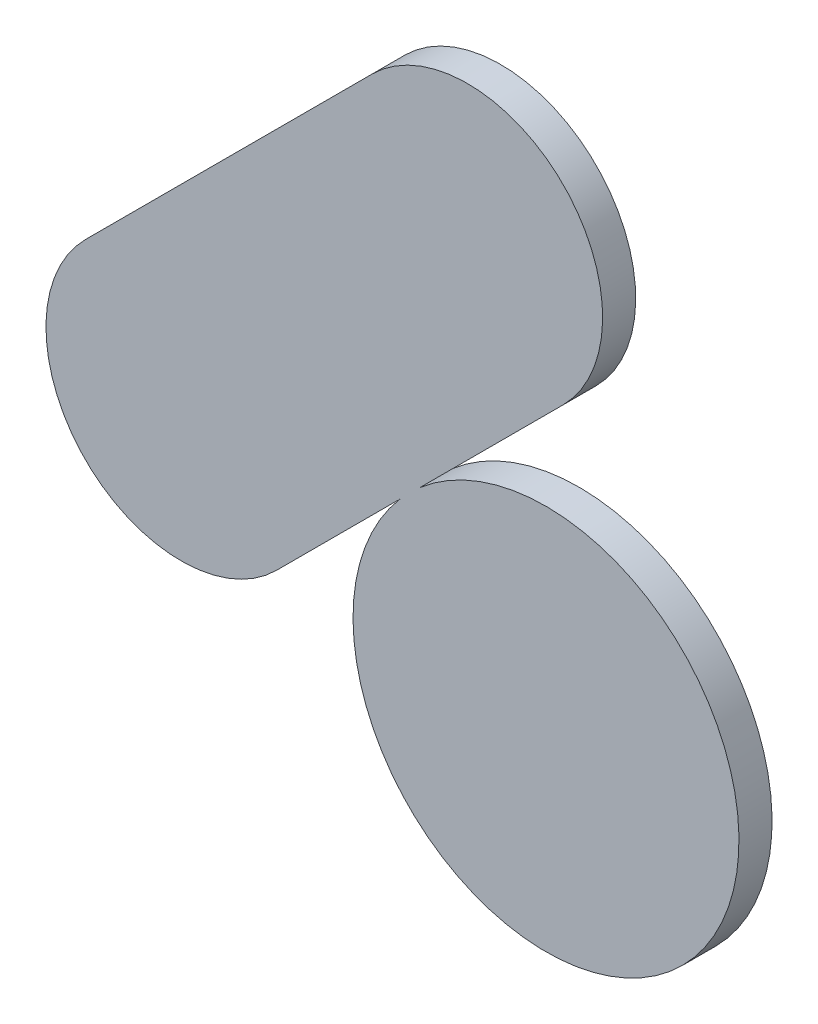
ISO-10303-21;
HEADER;
FILE_DESCRIPTION(('STEP AP214'),'2;1');
FILE_NAME('part.step','',(''),(''),'','','');
FILE_SCHEMA(('AUTOMOTIVE_DESIGN { 1 0 10303 214 1 1 1 1 }'));
ENDSEC;
DATA;
#1=APPLICATION_CONTEXT('core data for automotive mechanical design processes');
#2=APPLICATION_PROTOCOL_DEFINITION('international standard','automotive_design',2000,#1);
#3=PRODUCT_CONTEXT('',#1,'mechanical');
#4=PRODUCT('Part','Part','',(#3));
#5=PRODUCT_RELATED_PRODUCT_CATEGORY('part','',(#4));
#6=PRODUCT_DEFINITION_FORMATION('','',#4);
#7=PRODUCT_DEFINITION_CONTEXT('part definition',#1,'design');
#8=PRODUCT_DEFINITION('design','',#6,#7);
#9=PRODUCT_DEFINITION_SHAPE('','',#8);
#10=(LENGTH_UNIT() NAMED_UNIT(*) SI_UNIT(.MILLI.,.METRE.));
#11=(NAMED_UNIT(*) PLANE_ANGLE_UNIT() SI_UNIT($,.RADIAN.));
#12=(NAMED_UNIT(*) SI_UNIT($,.STERADIAN.) SOLID_ANGLE_UNIT());
#13=UNCERTAINTY_MEASURE_WITH_UNIT(LENGTH_MEASURE(1.E-05),#10,'distance_accuracy_value','');
#14=(GEOMETRIC_REPRESENTATION_CONTEXT(3) GLOBAL_UNCERTAINTY_ASSIGNED_CONTEXT((#13)) GLOBAL_UNIT_ASSIGNED_CONTEXT((#10,
#11,#12)) REPRESENTATION_CONTEXT('',''));
#15=CARTESIAN_POINT('',(0.,0.,0.));
#16=DIRECTION('',(0.,0.,1.));
#17=DIRECTION('',(1.,0.,0.));
#18=AXIS2_PLACEMENT_3D('',#15,#16,#17);
#19=CARTESIAN_POINT('',(4.884906784897,1.989149072895,0.76487));
#20=DIRECTION('',(0.,0.,-1.));
#21=DIRECTION('',(-1.,0.,0.));
#22=AXIS2_PLACEMENT_3D('',#19,#20,#21);
#23=PLANE('',#22);
#24=DIRECTION('',(-0.707105419013235,-0.707108143357235,0.));
#25=VECTOR('',#24,1.);
#26=CARTESIAN_POINT('',(5.0341823809,2.141318953102,0.76487));
#27=LINE('',#26,#25);
#28=CARTESIAN_POINT('',(5.03418264275081,2.14131921495382,0.76487));
#29=VERTEX_POINT('',#28);
#30=CARTESIAN_POINT('',(4.88566689599835,1.99280289599816,0.76487));
#31=VERTEX_POINT('',#30);
#32=EDGE_CURVE('E66',#29,#31,#27,.T.);
#33=ORIENTED_EDGE('',*,*,#32,.T.);
#34=CARTESIAN_POINT('',(5.0165,1.8415,0.76487));
#35=DIRECTION('',(0.,0.,1.));
#36=DIRECTION('',(1.,0.,0.));
#37=AXIS2_PLACEMENT_3D('',#34,#35,#36);
#38=CIRCLE('',#37,0.200024667079);
#39=CARTESIAN_POINT('',(4.86519710590654,1.97233310608354,0.76487));
#40=VERTEX_POINT('',#39);
#41=EDGE_CURVE('E20',#40,#31,#38,.T.);
#42=ORIENTED_EDGE('',*,*,#41,.F.);
#43=DIRECTION('',(-0.707106780699048,-0.707106781674048,0.));
#44=VECTOR('',#43,1.);
#45=CARTESIAN_POINT('',(4.865197105905,1.972333106082,0.76487));
#46=LINE('',#45,#44);
#47=CARTESIAN_POINT('',(4.73719797471687,1.84433397471738,0.76487));
#48=VERTEX_POINT('',#47);
#49=EDGE_CURVE('E91',#40,#48,#46,.T.);
#50=ORIENTED_EDGE('',*,*,#49,.T.);
#51=CARTESIAN_POINT('',(4.638203,1.943328898732,0.76487));
#52=DIRECTION('',(0.,0.,1.));
#53=DIRECTION('',(1.,0.,0.));
#54=AXIS2_PLACEMENT_3D('',#51,#52,#53);
#55=CIRCLE('',#54,0.14);
#56=CARTESIAN_POINT('',(4.53920807191728,2.04232349971486,0.76487));
#57=VERTEX_POINT('',#56);
#58=EDGE_CURVE('E103',#57,#48,#55,.T.);
#59=ORIENTED_EDGE('',*,*,#58,.F.);
#60=DIRECTION('',(0.707106099992719,0.707107462379719,0.));
#61=VECTOR('',#60,1.);
#62=CARTESIAN_POINT('',(4.5392082861,2.042323713898,0.76487));
#63=LINE('',#62,#61);
#64=CARTESIAN_POINT('',(4.83619264463338,2.33930864463353,0.76487));
#65=VERTEX_POINT('',#64);
#66=EDGE_CURVE('E94',#57,#65,#63,.T.);
#67=ORIENTED_EDGE('',*,*,#66,.T.);
#68=CARTESIAN_POINT('',(4.935187667,2.240313768268,0.76487));
#69=DIRECTION('',(0.,0.,1.));
#70=DIRECTION('',(1.,0.,0.));
#71=AXIS2_PLACEMENT_3D('',#68,#69,#70);
#72=CIRCLE('',#71,0.14);
#73=EDGE_CURVE('E70',#29,#65,#72,.T.);
#74=ORIENTED_EDGE('',*,*,#73,.F.);
#75=EDGE_LOOP('',(#33,#42,#50,#59,#67,#74));
#76=FACE_BOUND('',#75,.T.);
#77=ADVANCED_FACE('F17',(#76),#23,.T.);
#78=CARTESIAN_POINT('',(5.0165,1.8415,0.76487));
#79=DIRECTION('',(0.,0.,1.));
#80=DIRECTION('',(1.,0.,0.));
#81=AXIS2_PLACEMENT_3D('',#78,#79,#80);
#82=CYLINDRICAL_SURFACE('',#81,0.200024667079);
#83=ORIENTED_EDGE('',*,*,#41,.T.);
#84=DIRECTION('',(0.,0.,1.));
#85=VECTOR('',#84,1.);
#86=CARTESIAN_POINT('',(4.8856668960001,1.9928028959999,0.76487));
#87=LINE('',#86,#85);
#88=CARTESIAN_POINT('',(4.88566689599764,1.99280289599755,0.79916));
#89=VERTEX_POINT('',#88);
#90=EDGE_CURVE('E74',#31,#89,#87,.T.);
#91=ORIENTED_EDGE('',*,*,#90,.T.);
#92=CARTESIAN_POINT('',(5.0165,1.8415,0.79916));
#93=DIRECTION('',(0.,0.,1.));
#94=DIRECTION('',(1.,0.,0.));
#95=AXIS2_PLACEMENT_3D('',#92,#93,#94);
#96=CIRCLE('',#95,0.200024667);
#97=CARTESIAN_POINT('',(4.86519710590654,1.97233310608354,0.79916));
#98=VERTEX_POINT('',#97);
#99=EDGE_CURVE('E101',#98,#89,#96,.T.);
#100=ORIENTED_EDGE('',*,*,#99,.F.);
#101=DIRECTION('',(0.,0.,1.));
#102=VECTOR('',#101,1.);
#103=CARTESIAN_POINT('',(4.865197105905,1.972333106082,0.76487));
#104=LINE('',#103,#102);
#105=EDGE_CURVE('E81',#98,#40,#104,.F.);
#106=ORIENTED_EDGE('',*,*,#105,.T.);
#107=EDGE_LOOP('',(#83,#91,#100,#106));
#108=FACE_BOUND('',#107,.T.);
#109=ADVANCED_FACE('F78',(#108),#82,.T.);
#110=CARTESIAN_POINT('',(5.0341823809,2.141318953102,0.76487));
#111=DIRECTION('',(-0.707108143357235,0.707105419013235,0.));
#112=DIRECTION('',(-0.707105419013235,-0.707108143357235,0.));
#113=AXIS2_PLACEMENT_3D('',#110,#111,#112);
#114=PLANE('',#113);
#115=ORIENTED_EDGE('',*,*,#90,.F.);
#116=ORIENTED_EDGE('',*,*,#32,.F.);
#117=DIRECTION('',(0.,0.,1.));
#118=VECTOR('',#117,1.);
#119=CARTESIAN_POINT('',(5.0341823809,2.141318953102,0.76487));
#120=LINE('',#119,#118);
#121=CARTESIAN_POINT('',(5.03418264275078,2.14131921495379,0.79916));
#122=VERTEX_POINT('',#121);
#123=EDGE_CURVE('E86',#122,#29,#120,.F.);
#124=ORIENTED_EDGE('',*,*,#123,.F.);
#125=DIRECTION('',(0.707105419013689,0.707108143356782,0.));
#126=VECTOR('',#125,1.);
#127=CARTESIAN_POINT('',(4.885666896,1.992802896,0.79916));
#128=LINE('',#127,#126);
#129=EDGE_CURVE('E85',#89,#122,#128,.T.);
#130=ORIENTED_EDGE('',*,*,#129,.F.);
#131=EDGE_LOOP('',(#115,#116,#124,#130));
#132=FACE_BOUND('',#131,.T.);
#133=ADVANCED_FACE('F83',(#132),#114,.F.);
#134=CARTESIAN_POINT('',(4.935187667,2.240313768268,0.76487));
#135=DIRECTION('',(0.,0.,1.));
#136=DIRECTION('',(1.,0.,0.));
#137=AXIS2_PLACEMENT_3D('',#134,#135,#136);
#138=CYLINDRICAL_SURFACE('',#137,0.14);
#139=ORIENTED_EDGE('',*,*,#73,.T.);
#140=DIRECTION('',(0.,0.,1.));
#141=VECTOR('',#140,1.);
#142=CARTESIAN_POINT('',(4.8361926669999,2.3393086670001,0.76487));
#143=LINE('',#142,#141);
#144=CARTESIAN_POINT('',(4.83619264463344,2.3393086446335,0.79916));
#145=VERTEX_POINT('',#144);
#146=EDGE_CURVE('E95',#65,#145,#143,.T.);
#147=ORIENTED_EDGE('',*,*,#146,.T.);
#148=CARTESIAN_POINT('',(4.935188,2.240314,0.79916));
#149=DIRECTION('',(0.,0.,1.));
#150=DIRECTION('',(1.,0.,0.));
#151=AXIS2_PLACEMENT_3D('',#148,#149,#150);
#152=CIRCLE('',#151,0.139999667);
#153=EDGE_CURVE('E99',#122,#145,#152,.T.);
#154=ORIENTED_EDGE('',*,*,#153,.F.);
#155=ORIENTED_EDGE('',*,*,#123,.T.);
#156=EDGE_LOOP('',(#139,#147,#154,#155));
#157=FACE_BOUND('',#156,.T.);
#158=ADVANCED_FACE('F109',(#157),#138,.T.);
#159=CARTESIAN_POINT('',(4.5392082861,2.042323713898,0.76487));
#160=DIRECTION('',(0.707107462379719,-0.707106099992719,0.));
#161=DIRECTION('',(0.707106099992719,0.707107462379719,0.));
#162=AXIS2_PLACEMENT_3D('',#159,#160,#161);
#163=PLANE('',#162);
#164=ORIENTED_EDGE('',*,*,#146,.F.);
#165=ORIENTED_EDGE('',*,*,#66,.F.);
#166=DIRECTION('',(0.,0.,1.));
#167=VECTOR('',#166,1.);
#168=CARTESIAN_POINT('',(4.5392082861,2.042323713898,0.76487));
#169=LINE('',#168,#167);
#170=CARTESIAN_POINT('',(4.53920807191729,2.04232349971488,0.79916));
#171=VERTEX_POINT('',#170);
#172=EDGE_CURVE('E105',#171,#57,#169,.F.);
#173=ORIENTED_EDGE('',*,*,#172,.F.);
#174=DIRECTION('',(-0.707106099992947,-0.707107462379492,0.));
#175=VECTOR('',#174,1.);
#176=CARTESIAN_POINT('',(4.836192667,2.339308667,0.79916));
#177=LINE('',#176,#175);
#178=EDGE_CURVE('E98',#145,#171,#177,.T.);
#179=ORIENTED_EDGE('',*,*,#178,.F.);
#180=EDGE_LOOP('',(#164,#165,#173,#179));
#181=FACE_BOUND('',#180,.T.);
#182=ADVANCED_FACE('F114',(#181),#163,.F.);
#183=CARTESIAN_POINT('',(4.638203,1.943328898732,0.76487));
#184=DIRECTION('',(0.,0.,1.));
#185=DIRECTION('',(1.,0.,0.));
#186=AXIS2_PLACEMENT_3D('',#183,#184,#185);
#187=CYLINDRICAL_SURFACE('',#186,0.14);
#188=ORIENTED_EDGE('',*,*,#58,.T.);
#189=DIRECTION('',(0.,0.,1.));
#190=VECTOR('',#189,1.);
#191=CARTESIAN_POINT('',(4.73719799999975,1.84433400000025,0.76487));
#192=LINE('',#191,#190);
#193=CARTESIAN_POINT('',(4.7371979747171,1.84433397471735,0.79916));
#194=VERTEX_POINT('',#193);
#195=EDGE_CURVE('E93',#48,#194,#192,.T.);
#196=ORIENTED_EDGE('',*,*,#195,.T.);
#197=CARTESIAN_POINT('',(4.638202667,1.943328667,0.79916));
#198=DIRECTION('',(0.,0.,1.));
#199=DIRECTION('',(1.,0.,0.));
#200=AXIS2_PLACEMENT_3D('',#197,#198,#199);
#201=CIRCLE('',#200,0.139999667);
#202=EDGE_CURVE('E26',#171,#194,#201,.T.);
#203=ORIENTED_EDGE('',*,*,#202,.F.);
#204=ORIENTED_EDGE('',*,*,#172,.T.);
#205=EDGE_LOOP('',(#188,#196,#203,#204));
#206=FACE_BOUND('',#205,.T.);
#207=ADVANCED_FACE('F127',(#206),#187,.T.);
#208=CARTESIAN_POINT('',(4.865197105905,1.972333106082,0.76487));
#209=DIRECTION('',(-0.707106781674048,0.707106780699048,0.));
#210=DIRECTION('',(-0.707106780699048,-0.707106781674048,0.));
#211=AXIS2_PLACEMENT_3D('',#208,#209,#210);
#212=PLANE('',#211);
#213=ORIENTED_EDGE('',*,*,#195,.F.);
#214=ORIENTED_EDGE('',*,*,#49,.F.);
#215=ORIENTED_EDGE('',*,*,#105,.F.);
#216=DIRECTION('',(0.707106780697644,0.707106781675451,0.));
#217=VECTOR('',#216,1.);
#218=CARTESIAN_POINT('',(4.737198,1.844334,0.79916));
#219=LINE('',#218,#217);
#220=EDGE_CURVE('E11',#194,#98,#219,.T.);
#221=ORIENTED_EDGE('',*,*,#220,.F.);
#222=EDGE_LOOP('',(#213,#214,#215,#221));
#223=FACE_BOUND('',#222,.T.);
#224=ADVANCED_FACE('F125',(#223),#212,.F.);
#225=CARTESIAN_POINT('',(4.884906784897,1.989149072895,0.79916));
#226=DIRECTION('',(0.,0.,1.));
#227=DIRECTION('',(0.,-1.,0.));
#228=AXIS2_PLACEMENT_3D('',#225,#226,#227);
#229=PLANE('',#228);
#230=ORIENTED_EDGE('',*,*,#202,.T.);
#231=ORIENTED_EDGE('',*,*,#220,.T.);
#232=ORIENTED_EDGE('',*,*,#99,.T.);
#233=ORIENTED_EDGE('',*,*,#129,.T.);
#234=ORIENTED_EDGE('',*,*,#153,.T.);
#235=ORIENTED_EDGE('',*,*,#178,.T.);
#236=EDGE_LOOP('',(#230,#231,#232,#233,#234,#235));
#237=FACE_BOUND('',#236,.T.);
#238=ADVANCED_FACE('F121',(#237),#229,.T.);
#239=CLOSED_SHELL('',(#77,#109,#133,#158,#182,#207,#224,#238));
#240=MANIFOLD_SOLID_BREP('B1',#239);
#241=ADVANCED_BREP_SHAPE_REPRESENTATION('',(#18,#240),#14);
#242=SHAPE_DEFINITION_REPRESENTATION(#9,#241);
ENDSEC;
END-ISO-10303-21;
